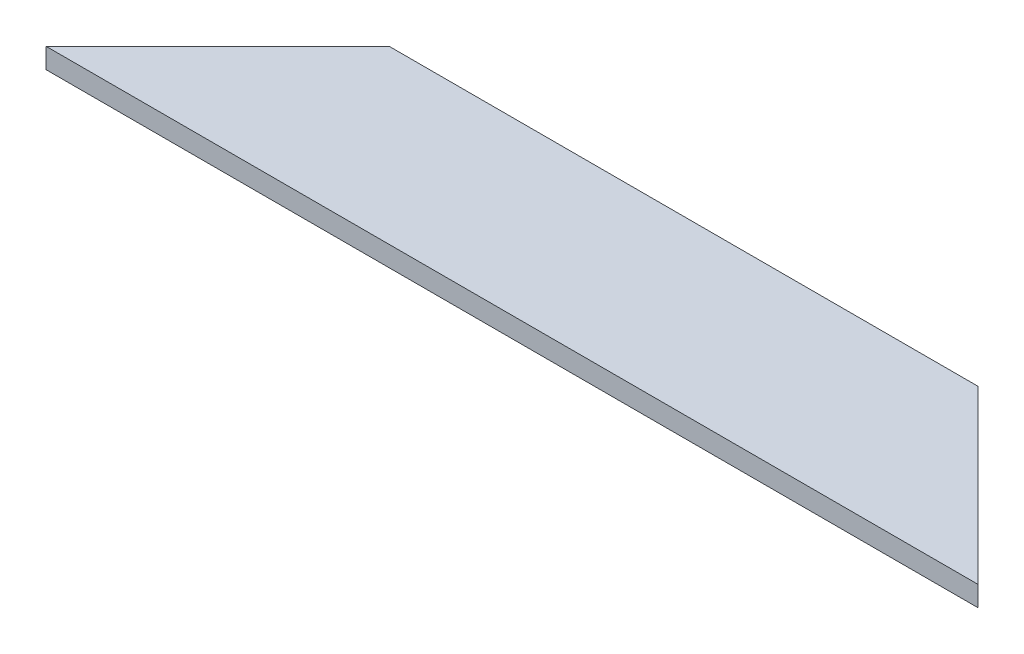
ISO-10303-21;
HEADER;
FILE_DESCRIPTION(('STEP AP214'),'2;1');
FILE_NAME('part.step','',(''),(''),'','','');
FILE_SCHEMA(('AUTOMOTIVE_DESIGN { 1 0 10303 214 1 1 1 1 }'));
ENDSEC;
DATA;
#1=APPLICATION_CONTEXT('core data for automotive mechanical design processes');
#2=APPLICATION_PROTOCOL_DEFINITION('international standard','automotive_design',2000,#1);
#3=PRODUCT_CONTEXT('',#1,'mechanical');
#4=PRODUCT('Part','Part','',(#3));
#5=PRODUCT_RELATED_PRODUCT_CATEGORY('part','',(#4));
#6=PRODUCT_DEFINITION_FORMATION('','',#4);
#7=PRODUCT_DEFINITION_CONTEXT('part definition',#1,'design');
#8=PRODUCT_DEFINITION('design','',#6,#7);
#9=PRODUCT_DEFINITION_SHAPE('','',#8);
#10=(LENGTH_UNIT() NAMED_UNIT(*) SI_UNIT(.MILLI.,.METRE.));
#11=(NAMED_UNIT(*) PLANE_ANGLE_UNIT() SI_UNIT($,.RADIAN.));
#12=(NAMED_UNIT(*) SI_UNIT($,.STERADIAN.) SOLID_ANGLE_UNIT());
#13=UNCERTAINTY_MEASURE_WITH_UNIT(LENGTH_MEASURE(1.E-05),#10,'distance_accuracy_value','');
#14=(GEOMETRIC_REPRESENTATION_CONTEXT(3) GLOBAL_UNCERTAINTY_ASSIGNED_CONTEXT((#13)) GLOBAL_UNIT_ASSIGNED_CONTEXT((#10,
#11,#12)) REPRESENTATION_CONTEXT('',''));
#15=CARTESIAN_POINT('',(0.,0.,0.));
#16=DIRECTION('',(0.,0.,1.));
#17=DIRECTION('',(1.,0.,0.));
#18=AXIS2_PLACEMENT_3D('',#15,#16,#17);
#19=CARTESIAN_POINT('',(45.4968368312694,3.,30.4389053258426));
#20=DIRECTION('',(-0.707106781186543,0.,0.707106781186552));
#21=DIRECTION('',(0.707106781186552,0.,0.707106781186543));
#22=AXIS2_PLACEMENT_3D('',#19,#20,#21);
#23=PLANE('',#22);
#24=DIRECTION('',(-0.707106781186552,0.,-0.707106781186543));
#25=VECTOR('',#24,1.);
#26=CARTESIAN_POINT('',(45.4968368312694,0.,30.4389053258426));
#27=LINE('',#26,#25);
#28=CARTESIAN_POINT('',(45.4968368312694,0.,30.4389053258426));
#29=VERTEX_POINT('',#28);
#30=CARTESIAN_POINT('',(20.0968368312691,0.,5.03890532584258));
#31=VERTEX_POINT('',#30);
#32=EDGE_CURVE('E96',#29,#31,#27,.T.);
#33=ORIENTED_EDGE('',*,*,#32,.T.);
#34=DIRECTION('',(0.,-1.,0.));
#35=VECTOR('',#34,1.);
#36=CARTESIAN_POINT('',(20.0968368312691,3.,5.03890532584258));
#37=LINE('',#36,#35);
#38=CARTESIAN_POINT('',(20.0968368312691,3.,5.03890532584258));
#39=VERTEX_POINT('',#38);
#40=EDGE_CURVE('E11',#39,#31,#37,.T.);
#41=ORIENTED_EDGE('',*,*,#40,.F.);
#42=DIRECTION('',(-0.707106781186552,0.,-0.707106781186543));
#43=VECTOR('',#42,1.);
#44=CARTESIAN_POINT('',(45.4968368312694,3.,30.4389053258426));
#45=LINE('',#44,#43);
#46=CARTESIAN_POINT('',(45.4968368312694,3.,30.4389053258426));
#47=VERTEX_POINT('',#46);
#48=EDGE_CURVE('E84',#47,#39,#45,.T.);
#49=ORIENTED_EDGE('',*,*,#48,.F.);
#50=DIRECTION('',(0.,-1.,0.));
#51=VECTOR('',#50,1.);
#52=CARTESIAN_POINT('',(45.4968368312694,3.,30.4389053258426));
#53=LINE('',#52,#51);
#54=EDGE_CURVE('E92',#47,#29,#53,.T.);
#55=ORIENTED_EDGE('',*,*,#54,.T.);
#56=EDGE_LOOP('',(#33,#41,#49,#55));
#57=FACE_BOUND('',#56,.T.);
#58=ADVANCED_FACE('F33',(#57),#23,.F.);
#59=CARTESIAN_POINT('',(-67.1031631687307,3.,5.0389053258426));
#60=DIRECTION('',(0.,0.,1.));
#61=DIRECTION('',(1.,0.,0.));
#62=AXIS2_PLACEMENT_3D('',#59,#60,#61);
#63=PLANE('',#62);
#64=DIRECTION('',(-1.,0.,0.));
#65=VECTOR('',#64,1.);
#66=CARTESIAN_POINT('',(-67.1031631687307,0.,5.0389053258426));
#67=LINE('',#66,#65);
#68=CARTESIAN_POINT('',(-67.1031631687307,0.,5.0389053258426));
#69=VERTEX_POINT('',#68);
#70=EDGE_CURVE('E88',#31,#69,#67,.T.);
#71=ORIENTED_EDGE('',*,*,#70,.T.);
#72=DIRECTION('',(0.,-1.,0.));
#73=VECTOR('',#72,1.);
#74=CARTESIAN_POINT('',(-67.1031631687307,3.,5.0389053258426));
#75=LINE('',#74,#73);
#76=CARTESIAN_POINT('',(-67.1031631687307,3.,5.0389053258426));
#77=VERTEX_POINT('',#76);
#78=EDGE_CURVE('E41',#77,#69,#75,.T.);
#79=ORIENTED_EDGE('',*,*,#78,.F.);
#80=DIRECTION('',(-1.,0.,0.));
#81=VECTOR('',#80,1.);
#82=CARTESIAN_POINT('',(-67.1031631687307,3.,5.0389053258426));
#83=LINE('',#82,#81);
#84=EDGE_CURVE('E79',#39,#77,#83,.T.);
#85=ORIENTED_EDGE('',*,*,#84,.F.);
#86=ORIENTED_EDGE('',*,*,#40,.T.);
#87=EDGE_LOOP('',(#71,#79,#85,#86));
#88=FACE_BOUND('',#87,.T.);
#89=ADVANCED_FACE('F87',(#88),#63,.F.);
#90=CARTESIAN_POINT('',(-92.5031631687306,3.,30.4389053258426));
#91=DIRECTION('',(0.707106781186549,0.,0.707106781186546));
#92=DIRECTION('',(0.707106781186546,0.,-0.707106781186549));
#93=AXIS2_PLACEMENT_3D('',#90,#91,#92);
#94=PLANE('',#93);
#95=DIRECTION('',(-0.707106781186546,0.,0.707106781186549));
#96=VECTOR('',#95,1.);
#97=CARTESIAN_POINT('',(-92.5031631687306,0.,30.4389053258426));
#98=LINE('',#97,#96);
#99=CARTESIAN_POINT('',(-92.5031631687306,0.,30.4389053258426));
#100=VERTEX_POINT('',#99);
#101=EDGE_CURVE('E66',#69,#100,#98,.T.);
#102=ORIENTED_EDGE('',*,*,#101,.T.);
#103=DIRECTION('',(0.,-1.,0.));
#104=VECTOR('',#103,1.);
#105=CARTESIAN_POINT('',(-92.5031631687306,3.,30.4389053258426));
#106=LINE('',#105,#104);
#107=CARTESIAN_POINT('',(-92.5031631687306,3.,30.4389053258426));
#108=VERTEX_POINT('',#107);
#109=EDGE_CURVE('E89',#108,#100,#106,.T.);
#110=ORIENTED_EDGE('',*,*,#109,.F.);
#111=DIRECTION('',(-0.707106781186546,0.,0.707106781186549));
#112=VECTOR('',#111,1.);
#113=CARTESIAN_POINT('',(-92.5031631687306,3.,30.4389053258426));
#114=LINE('',#113,#112);
#115=EDGE_CURVE('E82',#77,#108,#114,.T.);
#116=ORIENTED_EDGE('',*,*,#115,.F.);
#117=ORIENTED_EDGE('',*,*,#78,.T.);
#118=EDGE_LOOP('',(#102,#110,#116,#117));
#119=FACE_BOUND('',#118,.T.);
#120=ADVANCED_FACE('F90',(#119),#94,.F.);
#121=CARTESIAN_POINT('',(-92.5031631687306,3.,30.4389053258426));
#122=DIRECTION('',(0.,0.,-1.));
#123=DIRECTION('',(-1.,0.,0.));
#124=AXIS2_PLACEMENT_3D('',#121,#122,#123);
#125=PLANE('',#124);
#126=DIRECTION('',(1.,0.,0.));
#127=VECTOR('',#126,1.);
#128=CARTESIAN_POINT('',(-92.5031631687306,0.,30.4389053258426));
#129=LINE('',#128,#127);
#130=EDGE_CURVE('E72',#100,#29,#129,.T.);
#131=ORIENTED_EDGE('',*,*,#130,.T.);
#132=ORIENTED_EDGE('',*,*,#54,.F.);
#133=DIRECTION('',(1.,0.,0.));
#134=VECTOR('',#133,1.);
#135=CARTESIAN_POINT('',(-92.5031631687306,3.,30.4389053258426));
#136=LINE('',#135,#134);
#137=EDGE_CURVE('E49',#108,#47,#136,.T.);
#138=ORIENTED_EDGE('',*,*,#137,.F.);
#139=ORIENTED_EDGE('',*,*,#109,.T.);
#140=EDGE_LOOP('',(#131,#132,#138,#139));
#141=FACE_BOUND('',#140,.T.);
#142=ADVANCED_FACE('F103',(#141),#125,.F.);
#143=CARTESIAN_POINT('',(0.,3.,0.));
#144=DIRECTION('',(0.,-1.,0.));
#145=DIRECTION('',(0.,0.,-1.));
#146=AXIS2_PLACEMENT_3D('',#143,#144,#145);
#147=PLANE('',#146);
#148=ORIENTED_EDGE('',*,*,#48,.T.);
#149=ORIENTED_EDGE('',*,*,#84,.T.);
#150=ORIENTED_EDGE('',*,*,#115,.T.);
#151=ORIENTED_EDGE('',*,*,#137,.T.);
#152=EDGE_LOOP('',(#148,#149,#150,#151));
#153=FACE_BOUND('',#152,.T.);
#154=ADVANCED_FACE('F80',(#153),#147,.F.);
#155=CARTESIAN_POINT('',(0.,0.,0.));
#156=DIRECTION('',(0.,-1.,0.));
#157=DIRECTION('',(0.,0.,-1.));
#158=AXIS2_PLACEMENT_3D('',#155,#156,#157);
#159=PLANE('',#158);
#160=ORIENTED_EDGE('',*,*,#32,.F.);
#161=ORIENTED_EDGE('',*,*,#130,.F.);
#162=ORIENTED_EDGE('',*,*,#101,.F.);
#163=ORIENTED_EDGE('',*,*,#70,.F.);
#164=EDGE_LOOP('',(#160,#161,#162,#163));
#165=FACE_BOUND('',#164,.T.);
#166=ADVANCED_FACE('F106',(#165),#159,.T.);
#167=CLOSED_SHELL('',(#58,#89,#120,#142,#154,#166));
#168=MANIFOLD_SOLID_BREP('B2',#167);
#169=ADVANCED_BREP_SHAPE_REPRESENTATION('',(#18,#168),#14);
#170=SHAPE_DEFINITION_REPRESENTATION(#9,#169);
ENDSEC;
END-ISO-10303-21;
